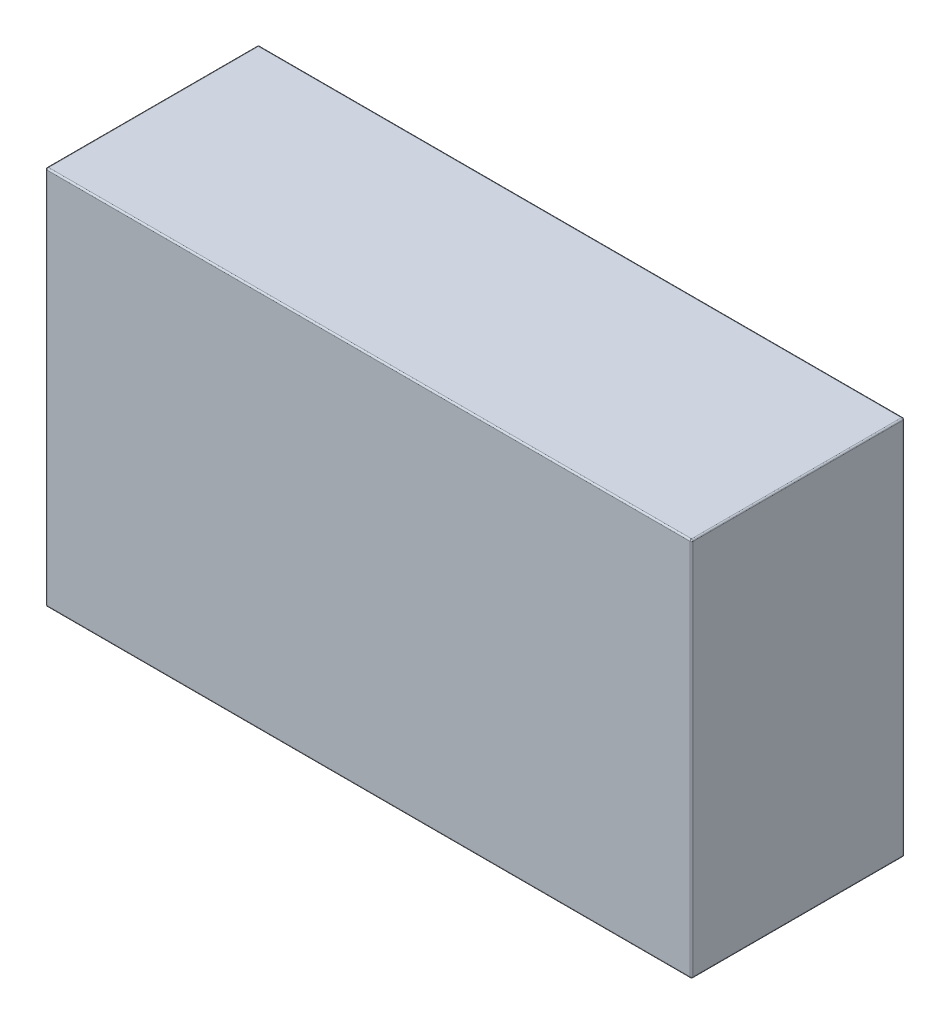
ISO-10303-21;
HEADER;
FILE_DESCRIPTION(('STEP AP214'),'2;1');
FILE_NAME('part.step','',(''),(''),'','','');
FILE_SCHEMA(('AUTOMOTIVE_DESIGN { 1 0 10303 214 1 1 1 1 }'));
ENDSEC;
DATA;
#1=APPLICATION_CONTEXT('core data for automotive mechanical design processes');
#2=APPLICATION_PROTOCOL_DEFINITION('international standard','automotive_design',2000,#1);
#3=PRODUCT_CONTEXT('',#1,'mechanical');
#4=PRODUCT('Part','Part','',(#3));
#5=PRODUCT_RELATED_PRODUCT_CATEGORY('part','',(#4));
#6=PRODUCT_DEFINITION_FORMATION('','',#4);
#7=PRODUCT_DEFINITION_CONTEXT('part definition',#1,'design');
#8=PRODUCT_DEFINITION('design','',#6,#7);
#9=PRODUCT_DEFINITION_SHAPE('','',#8);
#10=(LENGTH_UNIT() NAMED_UNIT(*) SI_UNIT(.MILLI.,.METRE.));
#11=(NAMED_UNIT(*) PLANE_ANGLE_UNIT() SI_UNIT($,.RADIAN.));
#12=(NAMED_UNIT(*) SI_UNIT($,.STERADIAN.) SOLID_ANGLE_UNIT());
#13=UNCERTAINTY_MEASURE_WITH_UNIT(LENGTH_MEASURE(1.E-05),#10,'distance_accuracy_value','');
#14=(GEOMETRIC_REPRESENTATION_CONTEXT(3) GLOBAL_UNCERTAINTY_ASSIGNED_CONTEXT((#13)) GLOBAL_UNIT_ASSIGNED_CONTEXT((#10,
#11,#12)) REPRESENTATION_CONTEXT('',''));
#15=CARTESIAN_POINT('',(0.,0.,0.));
#16=DIRECTION('',(0.,0.,1.));
#17=DIRECTION('',(1.,0.,0.));
#18=AXIS2_PLACEMENT_3D('',#15,#16,#17);
#19=CARTESIAN_POINT('',(53.975,31.75,17.78));
#20=DIRECTION('',(-1.,0.,0.));
#21=DIRECTION('',(0.,0.,1.));
#22=AXIS2_PLACEMENT_3D('',#19,#20,#21);
#23=PLANE('',#22);
#24=DIRECTION('',(0.,1.,0.));
#25=VECTOR('',#24,1.);
#26=CARTESIAN_POINT('',(53.975,-31.75,17.526));
#27=LINE('',#26,#25);
#28=CARTESIAN_POINT('',(53.975,31.496,17.526));
#29=VERTEX_POINT('',#28);
#30=CARTESIAN_POINT('',(53.975,-31.496,17.526));
#31=VERTEX_POINT('',#30);
#32=EDGE_CURVE('E225',#29,#31,#27,.F.);
#33=ORIENTED_EDGE('',*,*,#32,.T.);
#34=DIRECTION('',(0.,0.,-1.));
#35=VECTOR('',#34,1.);
#36=CARTESIAN_POINT('',(53.975,-31.496,17.78));
#37=LINE('',#36,#35);
#38=CARTESIAN_POINT('',(53.975,-31.496,-17.526));
#39=VERTEX_POINT('',#38);
#40=EDGE_CURVE('E232',#31,#39,#37,.T.);
#41=ORIENTED_EDGE('',*,*,#40,.T.);
#42=DIRECTION('',(0.,1.,0.));
#43=VECTOR('',#42,1.);
#44=CARTESIAN_POINT('',(53.975,31.75,-17.526));
#45=LINE('',#44,#43);
#46=CARTESIAN_POINT('',(53.975,31.496,-17.526));
#47=VERTEX_POINT('',#46);
#48=EDGE_CURVE('E228',#39,#47,#45,.T.);
#49=ORIENTED_EDGE('',*,*,#48,.T.);
#50=DIRECTION('',(0.,0.,-1.));
#51=VECTOR('',#50,1.);
#52=CARTESIAN_POINT('',(53.975,31.496,17.78));
#53=LINE('',#52,#51);
#54=EDGE_CURVE('E222',#47,#29,#53,.F.);
#55=ORIENTED_EDGE('',*,*,#54,.T.);
#56=EDGE_LOOP('',(#33,#41,#49,#55));
#57=FACE_BOUND('',#56,.T.);
#58=ADVANCED_FACE('F47',(#57),#23,.F.);
#59=CARTESIAN_POINT('',(-53.975,31.75,17.78));
#60=DIRECTION('',(0.,-1.,0.));
#61=DIRECTION('',(0.,0.,-1.));
#62=AXIS2_PLACEMENT_3D('',#59,#60,#61);
#63=PLANE('',#62);
#64=DIRECTION('',(-1.,0.,0.));
#65=VECTOR('',#64,1.);
#66=CARTESIAN_POINT('',(-53.975,31.75,-17.526));
#67=LINE('',#66,#65);
#68=CARTESIAN_POINT('',(53.721,31.75,-17.526));
#69=VERTEX_POINT('',#68);
#70=CARTESIAN_POINT('',(-53.721,31.75,-17.526));
#71=VERTEX_POINT('',#70);
#72=EDGE_CURVE('E148',#69,#71,#67,.T.);
#73=ORIENTED_EDGE('',*,*,#72,.T.);
#74=DIRECTION('',(0.,0.,-1.));
#75=VECTOR('',#74,1.);
#76=CARTESIAN_POINT('',(-53.721,31.75,17.78));
#77=LINE('',#76,#75);
#78=CARTESIAN_POINT('',(-53.721,31.75,17.526));
#79=VERTEX_POINT('',#78);
#80=EDGE_CURVE('E143',#71,#79,#77,.F.);
#81=ORIENTED_EDGE('',*,*,#80,.T.);
#82=DIRECTION('',(-1.,0.,0.));
#83=VECTOR('',#82,1.);
#84=CARTESIAN_POINT('',(53.975,31.75,17.526));
#85=LINE('',#84,#83);
#86=CARTESIAN_POINT('',(53.721,31.75,17.526));
#87=VERTEX_POINT('',#86);
#88=EDGE_CURVE('E135',#79,#87,#85,.F.);
#89=ORIENTED_EDGE('',*,*,#88,.T.);
#90=DIRECTION('',(0.,0.,-1.));
#91=VECTOR('',#90,1.);
#92=CARTESIAN_POINT('',(53.721,31.75,17.78));
#93=LINE('',#92,#91);
#94=EDGE_CURVE('E140',#87,#69,#93,.T.);
#95=ORIENTED_EDGE('',*,*,#94,.T.);
#96=EDGE_LOOP('',(#73,#81,#89,#95));
#97=FACE_BOUND('',#96,.T.);
#98=ADVANCED_FACE('F138',(#97),#63,.F.);
#99=CARTESIAN_POINT('',(-53.975,31.75,17.78));
#100=DIRECTION('',(1.,0.,0.));
#101=DIRECTION('',(0.,1.,0.));
#102=AXIS2_PLACEMENT_3D('',#99,#100,#101);
#103=PLANE('',#102);
#104=DIRECTION('',(0.,-1.,0.));
#105=VECTOR('',#104,1.);
#106=CARTESIAN_POINT('',(-53.975,31.75,-17.526));
#107=LINE('',#106,#105);
#108=CARTESIAN_POINT('',(-53.975,31.496,-17.526));
#109=VERTEX_POINT('',#108);
#110=CARTESIAN_POINT('',(-53.975,-31.496,-17.526));
#111=VERTEX_POINT('',#110);
#112=EDGE_CURVE('E202',#109,#111,#107,.T.);
#113=ORIENTED_EDGE('',*,*,#112,.T.);
#114=DIRECTION('',(0.,0.,-1.));
#115=VECTOR('',#114,1.);
#116=CARTESIAN_POINT('',(-53.975,-31.496,17.78));
#117=LINE('',#116,#115);
#118=CARTESIAN_POINT('',(-53.975,-31.496,17.526));
#119=VERTEX_POINT('',#118);
#120=EDGE_CURVE('E206',#111,#119,#117,.F.);
#121=ORIENTED_EDGE('',*,*,#120,.T.);
#122=DIRECTION('',(0.,-1.,0.));
#123=VECTOR('',#122,1.);
#124=CARTESIAN_POINT('',(-53.975,31.75,17.526));
#125=LINE('',#124,#123);
#126=CARTESIAN_POINT('',(-53.975,31.496,17.526));
#127=VERTEX_POINT('',#126);
#128=EDGE_CURVE('E199',#119,#127,#125,.F.);
#129=ORIENTED_EDGE('',*,*,#128,.T.);
#130=DIRECTION('',(0.,0.,-1.));
#131=VECTOR('',#130,1.);
#132=CARTESIAN_POINT('',(-53.975,31.496,17.78));
#133=LINE('',#132,#131);
#134=EDGE_CURVE('E196',#127,#109,#133,.T.);
#135=ORIENTED_EDGE('',*,*,#134,.T.);
#136=EDGE_LOOP('',(#113,#121,#129,#135));
#137=FACE_BOUND('',#136,.T.);
#138=ADVANCED_FACE('F325',(#137),#103,.F.);
#139=CARTESIAN_POINT('',(-53.975,-31.75,17.78));
#140=DIRECTION('',(0.,1.,0.));
#141=DIRECTION('',(0.,0.,1.));
#142=AXIS2_PLACEMENT_3D('',#139,#140,#141);
#143=PLANE('',#142);
#144=DIRECTION('',(1.,0.,0.));
#145=VECTOR('',#144,1.);
#146=CARTESIAN_POINT('',(-53.975,-31.75,-17.526));
#147=LINE('',#146,#145);
#148=CARTESIAN_POINT('',(-53.721,-31.75,-17.526));
#149=VERTEX_POINT('',#148);
#150=CARTESIAN_POINT('',(53.721,-31.75,-17.526));
#151=VERTEX_POINT('',#150);
#152=EDGE_CURVE('E215',#149,#151,#147,.T.);
#153=ORIENTED_EDGE('',*,*,#152,.T.);
#154=DIRECTION('',(0.,0.,-1.));
#155=VECTOR('',#154,1.);
#156=CARTESIAN_POINT('',(53.721,-31.75,17.78));
#157=LINE('',#156,#155);
#158=CARTESIAN_POINT('',(53.721,-31.75,17.526));
#159=VERTEX_POINT('',#158);
#160=EDGE_CURVE('E219',#151,#159,#157,.F.);
#161=ORIENTED_EDGE('',*,*,#160,.T.);
#162=DIRECTION('',(1.,0.,0.));
#163=VECTOR('',#162,1.);
#164=CARTESIAN_POINT('',(-53.975,-31.75,17.526));
#165=LINE('',#164,#163);
#166=CARTESIAN_POINT('',(-53.721,-31.75,17.526));
#167=VERTEX_POINT('',#166);
#168=EDGE_CURVE('E212',#159,#167,#165,.F.);
#169=ORIENTED_EDGE('',*,*,#168,.T.);
#170=DIRECTION('',(0.,0.,-1.));
#171=VECTOR('',#170,1.);
#172=CARTESIAN_POINT('',(-53.721,-31.75,17.78));
#173=LINE('',#172,#171);
#174=EDGE_CURVE('E209',#167,#149,#173,.T.);
#175=ORIENTED_EDGE('',*,*,#174,.T.);
#176=EDGE_LOOP('',(#153,#161,#169,#175));
#177=FACE_BOUND('',#176,.T.);
#178=ADVANCED_FACE('F334',(#177),#143,.F.);
#179=CARTESIAN_POINT('',(0.,0.,17.78));
#180=DIRECTION('',(0.,0.,1.));
#181=DIRECTION('',(1.,0.,0.));
#182=AXIS2_PLACEMENT_3D('',#179,#180,#181);
#183=PLANE('',#182);
#184=DIRECTION('',(0.,-1.,0.));
#185=VECTOR('',#184,1.);
#186=CARTESIAN_POINT('',(-53.721,-31.75,17.78));
#187=LINE('',#186,#185);
#188=CARTESIAN_POINT('',(-53.721,31.496,17.78));
#189=VERTEX_POINT('',#188);
#190=CARTESIAN_POINT('',(-53.721,-31.496,17.78));
#191=VERTEX_POINT('',#190);
#192=EDGE_CURVE('E57',#189,#191,#187,.T.);
#193=ORIENTED_EDGE('',*,*,#192,.T.);
#194=DIRECTION('',(1.,0.,0.));
#195=VECTOR('',#194,1.);
#196=CARTESIAN_POINT('',(53.975,-31.496,17.78));
#197=LINE('',#196,#195);
#198=CARTESIAN_POINT('',(53.721,-31.496,17.78));
#199=VERTEX_POINT('',#198);
#200=EDGE_CURVE('E11',#191,#199,#197,.T.);
#201=ORIENTED_EDGE('',*,*,#200,.T.);
#202=DIRECTION('',(0.,1.,0.));
#203=VECTOR('',#202,1.);
#204=CARTESIAN_POINT('',(53.721,31.75,17.78));
#205=LINE('',#204,#203);
#206=CARTESIAN_POINT('',(53.721,31.496,17.78));
#207=VERTEX_POINT('',#206);
#208=EDGE_CURVE('E235',#199,#207,#205,.T.);
#209=ORIENTED_EDGE('',*,*,#208,.T.);
#210=DIRECTION('',(-1.,0.,0.));
#211=VECTOR('',#210,1.);
#212=CARTESIAN_POINT('',(-53.975,31.496,17.78));
#213=LINE('',#212,#211);
#214=EDGE_CURVE('E68',#207,#189,#213,.T.);
#215=ORIENTED_EDGE('',*,*,#214,.T.);
#216=EDGE_LOOP('',(#193,#201,#209,#215));
#217=FACE_BOUND('',#216,.T.);
#218=ADVANCED_FACE('F356',(#217),#183,.T.);
#219=CARTESIAN_POINT('',(0.,0.,-17.78));
#220=DIRECTION('',(0.,0.,1.));
#221=DIRECTION('',(1.,0.,0.));
#222=AXIS2_PLACEMENT_3D('',#219,#220,#221);
#223=PLANE('',#222);
#224=DIRECTION('',(0.,-1.,0.));
#225=VECTOR('',#224,1.);
#226=CARTESIAN_POINT('',(-53.721,0.,-17.78));
#227=LINE('',#226,#225);
#228=CARTESIAN_POINT('',(-53.721,-31.496,-17.78));
#229=VERTEX_POINT('',#228);
#230=CARTESIAN_POINT('',(-53.721,31.496,-17.78));
#231=VERTEX_POINT('',#230);
#232=EDGE_CURVE('E189',#229,#231,#227,.F.);
#233=ORIENTED_EDGE('',*,*,#232,.T.);
#234=DIRECTION('',(-1.,0.,0.));
#235=VECTOR('',#234,1.);
#236=CARTESIAN_POINT('',(0.,31.496,-17.78));
#237=LINE('',#236,#235);
#238=CARTESIAN_POINT('',(53.721,31.496,-17.78));
#239=VERTEX_POINT('',#238);
#240=EDGE_CURVE('E192',#231,#239,#237,.F.);
#241=ORIENTED_EDGE('',*,*,#240,.T.);
#242=DIRECTION('',(0.,1.,0.));
#243=VECTOR('',#242,1.);
#244=CARTESIAN_POINT('',(53.721,0.,-17.78));
#245=LINE('',#244,#243);
#246=CARTESIAN_POINT('',(53.721,-31.496,-17.78));
#247=VERTEX_POINT('',#246);
#248=EDGE_CURVE('E183',#239,#247,#245,.F.);
#249=ORIENTED_EDGE('',*,*,#248,.T.);
#250=DIRECTION('',(1.,0.,0.));
#251=VECTOR('',#250,1.);
#252=CARTESIAN_POINT('',(0.,-31.496,-17.78));
#253=LINE('',#252,#251);
#254=EDGE_CURVE('E186',#247,#229,#253,.F.);
#255=ORIENTED_EDGE('',*,*,#254,.T.);
#256=EDGE_LOOP('',(#233,#241,#249,#255));
#257=FACE_BOUND('',#256,.T.);
#258=ADVANCED_FACE('F358',(#257),#223,.F.);
#259=CARTESIAN_POINT('',(0.,-31.496,17.526));
#260=DIRECTION('',(-1.,0.,0.));
#261=DIRECTION('',(0.,0.,1.));
#262=AXIS2_PLACEMENT_3D('',#259,#260,#261);
#263=CYLINDRICAL_SURFACE('',#262,0.254);
#264=CARTESIAN_POINT('',(53.721,-31.496,17.526));
#265=DIRECTION('',(1.,0.,0.));
#266=DIRECTION('',(0.,0.,-1.));
#267=AXIS2_PLACEMENT_3D('',#264,#265,#266);
#268=CIRCLE('',#267,0.254);
#269=EDGE_CURVE('E51',#199,#159,#268,.T.);
#270=ORIENTED_EDGE('',*,*,#269,.F.);
#271=ORIENTED_EDGE('',*,*,#200,.F.);
#272=CARTESIAN_POINT('',(-53.721,-31.496,17.526));
#273=DIRECTION('',(-1.,0.,0.));
#274=DIRECTION('',(0.,0.,1.));
#275=AXIS2_PLACEMENT_3D('',#272,#273,#274);
#276=CIRCLE('',#275,0.254);
#277=EDGE_CURVE('E177',#167,#191,#276,.T.);
#278=ORIENTED_EDGE('',*,*,#277,.F.);
#279=ORIENTED_EDGE('',*,*,#168,.F.);
#280=EDGE_LOOP('',(#270,#271,#278,#279));
#281=FACE_BOUND('',#280,.T.);
#282=ADVANCED_FACE('F49',(#281),#263,.T.);
#283=CARTESIAN_POINT('',(53.721,-31.496,17.526));
#284=DIRECTION('',(0.,-1.,0.));
#285=DIRECTION('',(0.,0.,-1.));
#286=AXIS2_PLACEMENT_3D('',#283,#284,#285);
#287=SPHERICAL_SURFACE('',#286,0.254);
#288=CARTESIAN_POINT('',(53.721,-31.496,17.526));
#289=DIRECTION('',(0.,-1.,0.));
#290=DIRECTION('',(0.,0.,-1.));
#291=AXIS2_PLACEMENT_3D('',#288,#289,#290);
#292=CIRCLE('',#291,0.254);
#293=EDGE_CURVE('E302',#199,#31,#292,.F.);
#294=ORIENTED_EDGE('',*,*,#293,.F.);
#295=ORIENTED_EDGE('',*,*,#269,.T.);
#296=CARTESIAN_POINT('',(53.721,-31.496,17.526));
#297=DIRECTION('',(0.,0.,1.));
#298=DIRECTION('',(1.,0.,0.));
#299=AXIS2_PLACEMENT_3D('',#296,#297,#298);
#300=CIRCLE('',#299,0.254);
#301=EDGE_CURVE('E306',#31,#159,#300,.F.);
#302=ORIENTED_EDGE('',*,*,#301,.F.);
#303=EDGE_LOOP('',(#294,#295,#302));
#304=FACE_BOUND('',#303,.T.);
#305=ADVANCED_FACE('F352',(#304),#287,.T.);
#306=CARTESIAN_POINT('',(-53.721,-31.496,17.526));
#307=DIRECTION('',(0.,0.,1.));
#308=DIRECTION('',(1.,0.,0.));
#309=AXIS2_PLACEMENT_3D('',#306,#307,#308);
#310=SPHERICAL_SURFACE('',#309,0.254);
#311=CARTESIAN_POINT('',(-53.721,-31.496,17.526));
#312=DIRECTION('',(0.,0.,1.));
#313=DIRECTION('',(1.,0.,0.));
#314=AXIS2_PLACEMENT_3D('',#311,#312,#313);
#315=CIRCLE('',#314,0.254);
#316=EDGE_CURVE('E294',#167,#119,#315,.F.);
#317=ORIENTED_EDGE('',*,*,#316,.F.);
#318=ORIENTED_EDGE('',*,*,#277,.T.);
#319=CARTESIAN_POINT('',(-53.721,-31.496,17.526));
#320=DIRECTION('',(0.,-1.,0.));
#321=DIRECTION('',(0.,0.,-1.));
#322=AXIS2_PLACEMENT_3D('',#319,#320,#321);
#323=CIRCLE('',#322,0.254);
#324=EDGE_CURVE('E298',#119,#191,#323,.F.);
#325=ORIENTED_EDGE('',*,*,#324,.F.);
#326=EDGE_LOOP('',(#317,#318,#325));
#327=FACE_BOUND('',#326,.T.);
#328=ADVANCED_FACE('F315',(#327),#310,.T.);
#329=CARTESIAN_POINT('',(53.721,-31.496,17.78));
#330=DIRECTION('',(0.,0.,-1.));
#331=DIRECTION('',(-1.,0.,0.));
#332=AXIS2_PLACEMENT_3D('',#329,#330,#331);
#333=CYLINDRICAL_SURFACE('',#332,0.254);
#334=ORIENTED_EDGE('',*,*,#301,.T.);
#335=ORIENTED_EDGE('',*,*,#160,.F.);
#336=CARTESIAN_POINT('',(53.721,-31.496,-17.526));
#337=DIRECTION('',(0.,0.,-1.));
#338=DIRECTION('',(-1.,0.,0.));
#339=AXIS2_PLACEMENT_3D('',#336,#337,#338);
#340=CIRCLE('',#339,0.254);
#341=EDGE_CURVE('E287',#39,#151,#340,.T.);
#342=ORIENTED_EDGE('',*,*,#341,.F.);
#343=ORIENTED_EDGE('',*,*,#40,.F.);
#344=EDGE_LOOP('',(#334,#335,#342,#343));
#345=FACE_BOUND('',#344,.T.);
#346=ADVANCED_FACE('F346',(#345),#333,.T.);
#347=CARTESIAN_POINT('',(53.721,0.,17.526));
#348=DIRECTION('',(0.,-1.,0.));
#349=DIRECTION('',(0.,0.,-1.));
#350=AXIS2_PLACEMENT_3D('',#347,#348,#349);
#351=CYLINDRICAL_SURFACE('',#350,0.254);
#352=ORIENTED_EDGE('',*,*,#293,.T.);
#353=ORIENTED_EDGE('',*,*,#32,.F.);
#354=CARTESIAN_POINT('',(53.721,31.496,17.526));
#355=DIRECTION('',(0.,1.,0.));
#356=DIRECTION('',(0.,0.,1.));
#357=AXIS2_PLACEMENT_3D('',#354,#355,#356);
#358=CIRCLE('',#357,0.254);
#359=EDGE_CURVE('E158',#207,#29,#358,.T.);
#360=ORIENTED_EDGE('',*,*,#359,.F.);
#361=ORIENTED_EDGE('',*,*,#208,.F.);
#362=EDGE_LOOP('',(#352,#353,#360,#361));
#363=FACE_BOUND('',#362,.T.);
#364=ADVANCED_FACE('F355',(#363),#351,.T.);
#365=CARTESIAN_POINT('',(0.,31.496,17.526));
#366=DIRECTION('',(1.,0.,0.));
#367=DIRECTION('',(0.,0.,-1.));
#368=AXIS2_PLACEMENT_3D('',#365,#366,#367);
#369=CYLINDRICAL_SURFACE('',#368,0.254);
#370=CARTESIAN_POINT('',(-53.721,31.496,17.526));
#371=DIRECTION('',(-1.,0.,0.));
#372=DIRECTION('',(0.,0.,1.));
#373=AXIS2_PLACEMENT_3D('',#370,#371,#372);
#374=CIRCLE('',#373,0.254);
#375=EDGE_CURVE('E159',#189,#79,#374,.T.);
#376=ORIENTED_EDGE('',*,*,#375,.F.);
#377=ORIENTED_EDGE('',*,*,#214,.F.);
#378=CARTESIAN_POINT('',(53.721,31.496,17.526));
#379=DIRECTION('',(1.,0.,0.));
#380=DIRECTION('',(0.,0.,-1.));
#381=AXIS2_PLACEMENT_3D('',#378,#379,#380);
#382=CIRCLE('',#381,0.254);
#383=EDGE_CURVE('E151',#87,#207,#382,.T.);
#384=ORIENTED_EDGE('',*,*,#383,.F.);
#385=ORIENTED_EDGE('',*,*,#88,.F.);
#386=EDGE_LOOP('',(#376,#377,#384,#385));
#387=FACE_BOUND('',#386,.T.);
#388=ADVANCED_FACE('F153',(#387),#369,.T.);
#389=CARTESIAN_POINT('',(-53.721,0.,17.526));
#390=DIRECTION('',(0.,1.,0.));
#391=DIRECTION('',(-1.,0.,0.));
#392=AXIS2_PLACEMENT_3D('',#389,#390,#391);
#393=CYLINDRICAL_SURFACE('',#392,0.254);
#394=ORIENTED_EDGE('',*,*,#324,.T.);
#395=ORIENTED_EDGE('',*,*,#192,.F.);
#396=CARTESIAN_POINT('',(-53.721,31.496,17.526));
#397=DIRECTION('',(0.,1.,0.));
#398=DIRECTION('',(0.,0.,1.));
#399=AXIS2_PLACEMENT_3D('',#396,#397,#398);
#400=CIRCLE('',#399,0.254);
#401=EDGE_CURVE('E279',#127,#189,#400,.T.);
#402=ORIENTED_EDGE('',*,*,#401,.F.);
#403=ORIENTED_EDGE('',*,*,#128,.F.);
#404=EDGE_LOOP('',(#394,#395,#402,#403));
#405=FACE_BOUND('',#404,.T.);
#406=ADVANCED_FACE('F321',(#405),#393,.T.);
#407=CARTESIAN_POINT('',(-53.721,-31.496,17.78));
#408=DIRECTION('',(0.,0.,-1.));
#409=DIRECTION('',(-1.,0.,0.));
#410=AXIS2_PLACEMENT_3D('',#407,#408,#409);
#411=CYLINDRICAL_SURFACE('',#410,0.254);
#412=ORIENTED_EDGE('',*,*,#316,.T.);
#413=ORIENTED_EDGE('',*,*,#120,.F.);
#414=CARTESIAN_POINT('',(-53.721,-31.496,-17.526));
#415=DIRECTION('',(0.,0.,-1.));
#416=DIRECTION('',(-1.,0.,0.));
#417=AXIS2_PLACEMENT_3D('',#414,#415,#416);
#418=CIRCLE('',#417,0.254);
#419=EDGE_CURVE('E275',#149,#111,#418,.T.);
#420=ORIENTED_EDGE('',*,*,#419,.F.);
#421=ORIENTED_EDGE('',*,*,#174,.F.);
#422=EDGE_LOOP('',(#412,#413,#420,#421));
#423=FACE_BOUND('',#422,.T.);
#424=ADVANCED_FACE('F331',(#423),#411,.T.);
#425=CARTESIAN_POINT('',(-53.975,-31.496,-17.526));
#426=DIRECTION('',(1.,0.,0.));
#427=DIRECTION('',(0.,0.,-1.));
#428=AXIS2_PLACEMENT_3D('',#425,#426,#427);
#429=CYLINDRICAL_SURFACE('',#428,0.254);
#430=CARTESIAN_POINT('',(53.721,-31.496,-17.526));
#431=DIRECTION('',(1.,0.,0.));
#432=DIRECTION('',(0.,0.,-1.));
#433=AXIS2_PLACEMENT_3D('',#430,#431,#432);
#434=CIRCLE('',#433,0.254);
#435=EDGE_CURVE('E290',#151,#247,#434,.T.);
#436=ORIENTED_EDGE('',*,*,#435,.F.);
#437=ORIENTED_EDGE('',*,*,#152,.F.);
#438=CARTESIAN_POINT('',(-53.721,-31.496,-17.526));
#439=DIRECTION('',(-1.,0.,0.));
#440=DIRECTION('',(0.,0.,1.));
#441=AXIS2_PLACEMENT_3D('',#438,#439,#440);
#442=CIRCLE('',#441,0.254);
#443=EDGE_CURVE('E271',#229,#149,#442,.T.);
#444=ORIENTED_EDGE('',*,*,#443,.F.);
#445=ORIENTED_EDGE('',*,*,#254,.F.);
#446=EDGE_LOOP('',(#436,#437,#444,#445));
#447=FACE_BOUND('',#446,.T.);
#448=ADVANCED_FACE('F338',(#447),#429,.T.);
#449=CARTESIAN_POINT('',(53.721,-31.496,-17.526));
#450=DIRECTION('',(0.,-1.,0.));
#451=DIRECTION('',(0.,0.,-1.));
#452=AXIS2_PLACEMENT_3D('',#449,#450,#451);
#453=SPHERICAL_SURFACE('',#452,0.254);
#454=ORIENTED_EDGE('',*,*,#341,.T.);
#455=ORIENTED_EDGE('',*,*,#435,.T.);
#456=CARTESIAN_POINT('',(53.721,-31.496,-17.526));
#457=DIRECTION('',(0.,-1.,0.));
#458=DIRECTION('',(1.,0.,0.));
#459=AXIS2_PLACEMENT_3D('',#456,#457,#458);
#460=CIRCLE('',#459,0.254);
#461=EDGE_CURVE('E167',#39,#247,#460,.F.);
#462=ORIENTED_EDGE('',*,*,#461,.F.);
#463=EDGE_LOOP('',(#454,#455,#462));
#464=FACE_BOUND('',#463,.T.);
#465=ADVANCED_FACE('F412',(#464),#453,.T.);
#466=CARTESIAN_POINT('',(53.721,31.496,17.526));
#467=DIRECTION('',(0.,0.,1.));
#468=DIRECTION('',(1.,0.,0.));
#469=AXIS2_PLACEMENT_3D('',#466,#467,#468);
#470=SPHERICAL_SURFACE('',#469,0.254);
#471=ORIENTED_EDGE('',*,*,#383,.T.);
#472=ORIENTED_EDGE('',*,*,#359,.T.);
#473=CARTESIAN_POINT('',(53.721,31.496,17.526));
#474=DIRECTION('',(0.,0.,1.));
#475=DIRECTION('',(1.,0.,0.));
#476=AXIS2_PLACEMENT_3D('',#473,#474,#475);
#477=CIRCLE('',#476,0.254);
#478=EDGE_CURVE('E162',#87,#29,#477,.F.);
#479=ORIENTED_EDGE('',*,*,#478,.F.);
#480=EDGE_LOOP('',(#471,#472,#479));
#481=FACE_BOUND('',#480,.T.);
#482=ADVANCED_FACE('F163',(#481),#470,.T.);
#483=CARTESIAN_POINT('',(-53.721,31.496,17.526));
#484=DIRECTION('',(0.,0.,1.));
#485=DIRECTION('',(1.,0.,0.));
#486=AXIS2_PLACEMENT_3D('',#483,#484,#485);
#487=SPHERICAL_SURFACE('',#486,0.254);
#488=ORIENTED_EDGE('',*,*,#401,.T.);
#489=ORIENTED_EDGE('',*,*,#375,.T.);
#490=CARTESIAN_POINT('',(-53.721,31.496,17.526));
#491=DIRECTION('',(0.,0.,1.));
#492=DIRECTION('',(1.,0.,0.));
#493=AXIS2_PLACEMENT_3D('',#490,#491,#492);
#494=CIRCLE('',#493,0.254);
#495=EDGE_CURVE('E168',#127,#79,#494,.F.);
#496=ORIENTED_EDGE('',*,*,#495,.F.);
#497=EDGE_LOOP('',(#488,#489,#496));
#498=FACE_BOUND('',#497,.T.);
#499=ADVANCED_FACE('F405',(#498),#487,.T.);
#500=CARTESIAN_POINT('',(-53.721,-31.496,-17.526));
#501=DIRECTION('',(0.,-1.,0.));
#502=DIRECTION('',(0.,0.,-1.));
#503=AXIS2_PLACEMENT_3D('',#500,#501,#502);
#504=SPHERICAL_SURFACE('',#503,0.254);
#505=ORIENTED_EDGE('',*,*,#443,.T.);
#506=ORIENTED_EDGE('',*,*,#419,.T.);
#507=CARTESIAN_POINT('',(-53.721,-31.496,-17.526));
#508=DIRECTION('',(0.,-1.,0.));
#509=DIRECTION('',(0.,0.,-1.));
#510=AXIS2_PLACEMENT_3D('',#507,#508,#509);
#511=CIRCLE('',#510,0.254);
#512=EDGE_CURVE('E262',#229,#111,#511,.F.);
#513=ORIENTED_EDGE('',*,*,#512,.F.);
#514=EDGE_LOOP('',(#505,#506,#513));
#515=FACE_BOUND('',#514,.T.);
#516=ADVANCED_FACE('F401',(#515),#504,.T.);
#517=CARTESIAN_POINT('',(53.721,31.75,-17.526));
#518=DIRECTION('',(0.,1.,0.));
#519=DIRECTION('',(0.,0.,1.));
#520=AXIS2_PLACEMENT_3D('',#517,#518,#519);
#521=CYLINDRICAL_SURFACE('',#520,0.254);
#522=ORIENTED_EDGE('',*,*,#461,.T.);
#523=ORIENTED_EDGE('',*,*,#248,.F.);
#524=CARTESIAN_POINT('',(53.721,31.496,-17.526));
#525=DIRECTION('',(0.,1.,0.));
#526=DIRECTION('',(0.,0.,1.));
#527=AXIS2_PLACEMENT_3D('',#524,#525,#526);
#528=CIRCLE('',#527,0.254);
#529=EDGE_CURVE('E258',#47,#239,#528,.T.);
#530=ORIENTED_EDGE('',*,*,#529,.F.);
#531=ORIENTED_EDGE('',*,*,#48,.F.);
#532=EDGE_LOOP('',(#522,#523,#530,#531));
#533=FACE_BOUND('',#532,.T.);
#534=ADVANCED_FACE('F398',(#533),#521,.T.);
#535=CARTESIAN_POINT('',(53.721,31.496,17.78));
#536=DIRECTION('',(0.,0.,-1.));
#537=DIRECTION('',(-1.,0.,0.));
#538=AXIS2_PLACEMENT_3D('',#535,#536,#537);
#539=CYLINDRICAL_SURFACE('',#538,0.254);
#540=ORIENTED_EDGE('',*,*,#478,.T.);
#541=ORIENTED_EDGE('',*,*,#54,.F.);
#542=CARTESIAN_POINT('',(53.721,31.496,-17.526));
#543=DIRECTION('',(0.,0.,-1.));
#544=DIRECTION('',(-1.,0.,0.));
#545=AXIS2_PLACEMENT_3D('',#542,#543,#544);
#546=CIRCLE('',#545,0.254);
#547=EDGE_CURVE('E171',#69,#47,#546,.T.);
#548=ORIENTED_EDGE('',*,*,#547,.F.);
#549=ORIENTED_EDGE('',*,*,#94,.F.);
#550=EDGE_LOOP('',(#540,#541,#548,#549));
#551=FACE_BOUND('',#550,.T.);
#552=ADVANCED_FACE('F170',(#551),#539,.T.);
#553=CARTESIAN_POINT('',(-53.721,31.496,17.78));
#554=DIRECTION('',(0.,0.,-1.));
#555=DIRECTION('',(-1.,0.,0.));
#556=AXIS2_PLACEMENT_3D('',#553,#554,#555);
#557=CYLINDRICAL_SURFACE('',#556,0.254);
#558=ORIENTED_EDGE('',*,*,#495,.T.);
#559=ORIENTED_EDGE('',*,*,#80,.F.);
#560=CARTESIAN_POINT('',(-53.721,31.496,-17.526));
#561=DIRECTION('',(0.,0.,-1.));
#562=DIRECTION('',(-1.,0.,0.));
#563=AXIS2_PLACEMENT_3D('',#560,#561,#562);
#564=CIRCLE('',#563,0.254);
#565=EDGE_CURVE('E252',#109,#71,#564,.T.);
#566=ORIENTED_EDGE('',*,*,#565,.F.);
#567=ORIENTED_EDGE('',*,*,#134,.F.);
#568=EDGE_LOOP('',(#558,#559,#566,#567));
#569=FACE_BOUND('',#568,.T.);
#570=ADVANCED_FACE('F391',(#569),#557,.T.);
#571=CARTESIAN_POINT('',(-53.721,31.75,-17.526));
#572=DIRECTION('',(0.,-1.,0.));
#573=DIRECTION('',(1.,0.,0.));
#574=AXIS2_PLACEMENT_3D('',#571,#572,#573);
#575=CYLINDRICAL_SURFACE('',#574,0.254);
#576=ORIENTED_EDGE('',*,*,#512,.T.);
#577=ORIENTED_EDGE('',*,*,#112,.F.);
#578=CARTESIAN_POINT('',(-53.721,31.496,-17.526));
#579=DIRECTION('',(0.,1.,0.));
#580=DIRECTION('',(0.,0.,1.));
#581=AXIS2_PLACEMENT_3D('',#578,#579,#580);
#582=CIRCLE('',#581,0.254);
#583=EDGE_CURVE('E248',#231,#109,#582,.T.);
#584=ORIENTED_EDGE('',*,*,#583,.F.);
#585=ORIENTED_EDGE('',*,*,#232,.F.);
#586=EDGE_LOOP('',(#576,#577,#584,#585));
#587=FACE_BOUND('',#586,.T.);
#588=ADVANCED_FACE('F387',(#587),#575,.T.);
#589=CARTESIAN_POINT('',(53.721,31.496,-17.526));
#590=DIRECTION('',(1.,0.,0.));
#591=DIRECTION('',(0.,0.,-1.));
#592=AXIS2_PLACEMENT_3D('',#589,#590,#591);
#593=SPHERICAL_SURFACE('',#592,0.254);
#594=ORIENTED_EDGE('',*,*,#547,.T.);
#595=ORIENTED_EDGE('',*,*,#529,.T.);
#596=CARTESIAN_POINT('',(53.721,31.496,-17.526));
#597=DIRECTION('',(1.,0.,0.));
#598=DIRECTION('',(0.,1.,0.));
#599=AXIS2_PLACEMENT_3D('',#596,#597,#598);
#600=CIRCLE('',#599,0.254);
#601=EDGE_CURVE('E245',#69,#239,#600,.F.);
#602=ORIENTED_EDGE('',*,*,#601,.F.);
#603=EDGE_LOOP('',(#594,#595,#602));
#604=FACE_BOUND('',#603,.T.);
#605=ADVANCED_FACE('F383',(#604),#593,.T.);
#606=CARTESIAN_POINT('',(-53.721,31.496,-17.526));
#607=DIRECTION('',(-1.,0.,0.));
#608=DIRECTION('',(0.,0.,1.));
#609=AXIS2_PLACEMENT_3D('',#606,#607,#608);
#610=SPHERICAL_SURFACE('',#609,0.254);
#611=ORIENTED_EDGE('',*,*,#583,.T.);
#612=ORIENTED_EDGE('',*,*,#565,.T.);
#613=CARTESIAN_POINT('',(-53.721,31.496,-17.526));
#614=DIRECTION('',(-1.,0.,0.));
#615=DIRECTION('',(0.,0.,1.));
#616=AXIS2_PLACEMENT_3D('',#613,#614,#615);
#617=CIRCLE('',#616,0.254);
#618=EDGE_CURVE('E242',#231,#71,#617,.F.);
#619=ORIENTED_EDGE('',*,*,#618,.F.);
#620=EDGE_LOOP('',(#611,#612,#619));
#621=FACE_BOUND('',#620,.T.);
#622=ADVANCED_FACE('F379',(#621),#610,.T.);
#623=CARTESIAN_POINT('',(-53.975,31.496,-17.526));
#624=DIRECTION('',(-1.,0.,0.));
#625=DIRECTION('',(0.,0.,1.));
#626=AXIS2_PLACEMENT_3D('',#623,#624,#625);
#627=CYLINDRICAL_SURFACE('',#626,0.254);
#628=ORIENTED_EDGE('',*,*,#601,.T.);
#629=ORIENTED_EDGE('',*,*,#240,.F.);
#630=ORIENTED_EDGE('',*,*,#618,.T.);
#631=ORIENTED_EDGE('',*,*,#72,.F.);
#632=EDGE_LOOP('',(#628,#629,#630,#631));
#633=FACE_BOUND('',#632,.T.);
#634=ADVANCED_FACE('F376',(#633),#627,.T.);
#635=CLOSED_SHELL('',(#58,#98,#138,#178,#218,#258,#282,#305,#328,#346,#364,#388,#406,#424,#448,
#465,#482,#499,#516,#534,#552,#570,#588,#605,#622,#634));
#636=MANIFOLD_SOLID_BREP('B2',#635);
#637=ADVANCED_BREP_SHAPE_REPRESENTATION('',(#18,#636),#14);
#638=SHAPE_DEFINITION_REPRESENTATION(#9,#637);
ENDSEC;
END-ISO-10303-21;
